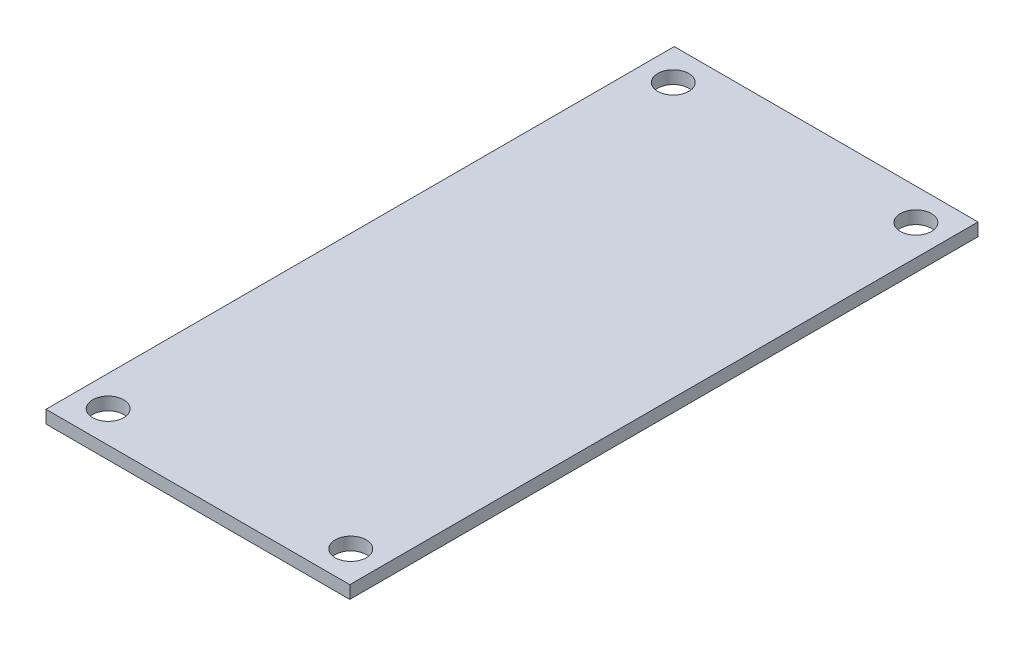
ISO-10303-21;
HEADER;
FILE_DESCRIPTION(('STEP AP214'),'2;1');
FILE_NAME('part.step','',(''),(''),'','','');
FILE_SCHEMA(('AUTOMOTIVE_DESIGN { 1 0 10303 214 1 1 1 1 }'));
ENDSEC;
DATA;
#1=APPLICATION_CONTEXT('core data for automotive mechanical design processes');
#2=APPLICATION_PROTOCOL_DEFINITION('international standard','automotive_design',2000,#1);
#3=PRODUCT_CONTEXT('',#1,'mechanical');
#4=PRODUCT('Part','Part','',(#3));
#5=PRODUCT_RELATED_PRODUCT_CATEGORY('part','',(#4));
#6=PRODUCT_DEFINITION_FORMATION('','',#4);
#7=PRODUCT_DEFINITION_CONTEXT('part definition',#1,'design');
#8=PRODUCT_DEFINITION('design','',#6,#7);
#9=PRODUCT_DEFINITION_SHAPE('','',#8);
#10=(LENGTH_UNIT() NAMED_UNIT(*) SI_UNIT(.MILLI.,.METRE.));
#11=(NAMED_UNIT(*) PLANE_ANGLE_UNIT() SI_UNIT($,.RADIAN.));
#12=(NAMED_UNIT(*) SI_UNIT($,.STERADIAN.) SOLID_ANGLE_UNIT());
#13=UNCERTAINTY_MEASURE_WITH_UNIT(LENGTH_MEASURE(1.E-05),#10,'distance_accuracy_value','');
#14=(GEOMETRIC_REPRESENTATION_CONTEXT(3) GLOBAL_UNCERTAINTY_ASSIGNED_CONTEXT((#13)) GLOBAL_UNIT_ASSIGNED_CONTEXT((#10,
#11,#12)) REPRESENTATION_CONTEXT('',''));
#15=CARTESIAN_POINT('',(0.,0.,0.));
#16=DIRECTION('',(0.,0.,1.));
#17=DIRECTION('',(1.,0.,0.));
#18=AXIS2_PLACEMENT_3D('',#15,#16,#17);
#19=CARTESIAN_POINT('',(0.,1.3,0.));
#20=DIRECTION('',(0.,-1.,0.));
#21=DIRECTION('',(0.,0.,-1.));
#22=AXIS2_PLACEMENT_3D('',#19,#20,#21);
#23=PLANE('',#22);
#24=DIRECTION('',(0.,0.,-1.));
#25=VECTOR('',#24,1.);
#26=CARTESIAN_POINT('',(15.4,1.3,31.85));
#27=LINE('',#26,#25);
#28=CARTESIAN_POINT('',(15.4,1.3,31.85));
#29=VERTEX_POINT('',#28);
#30=CARTESIAN_POINT('',(15.4,1.3,-31.85));
#31=VERTEX_POINT('',#30);
#32=EDGE_CURVE('E99',#29,#31,#27,.T.);
#33=ORIENTED_EDGE('',*,*,#32,.T.);
#34=DIRECTION('',(-1.,0.,0.));
#35=VECTOR('',#34,1.);
#36=CARTESIAN_POINT('',(-15.4,1.3,-31.85));
#37=LINE('',#36,#35);
#38=CARTESIAN_POINT('',(-15.4,1.3,-31.85));
#39=VERTEX_POINT('',#38);
#40=EDGE_CURVE('E94',#31,#39,#37,.T.);
#41=ORIENTED_EDGE('',*,*,#40,.T.);
#42=DIRECTION('',(0.,0.,1.));
#43=VECTOR('',#42,1.);
#44=CARTESIAN_POINT('',(-15.4,1.3,31.85));
#45=LINE('',#44,#43);
#46=CARTESIAN_POINT('',(-15.4,1.3,31.85));
#47=VERTEX_POINT('',#46);
#48=EDGE_CURVE('E97',#39,#47,#45,.T.);
#49=ORIENTED_EDGE('',*,*,#48,.T.);
#50=DIRECTION('',(1.,0.,0.));
#51=VECTOR('',#50,1.);
#52=CARTESIAN_POINT('',(-15.4,1.3,31.85));
#53=LINE('',#52,#51);
#54=EDGE_CURVE('E62',#47,#29,#53,.T.);
#55=ORIENTED_EDGE('',*,*,#54,.T.);
#56=EDGE_LOOP('',(#33,#41,#49,#55));
#57=FACE_BOUND('',#56,.T.);
#58=CARTESIAN_POINT('',(-12.3,1.3,-28.65));
#59=DIRECTION('',(0.,1.,0.));
#60=DIRECTION('',(0.,0.,1.));
#61=AXIS2_PLACEMENT_3D('',#58,#59,#60);
#62=CIRCLE('',#61,1.575);
#63=CARTESIAN_POINT('',(-12.3,1.3,-27.075));
#64=VERTEX_POINT('',#63);
#65=EDGE_CURVE('E120',#64,#64,#62,.T.);
#66=ORIENTED_EDGE('',*,*,#65,.F.);
#67=EDGE_LOOP('',(#66));
#68=FACE_BOUND('',#67,.T.);
#69=CARTESIAN_POINT('',(12.3,1.3,-28.65));
#70=DIRECTION('',(0.,1.,0.));
#71=DIRECTION('',(0.,0.,1.));
#72=AXIS2_PLACEMENT_3D('',#69,#70,#71);
#73=CIRCLE('',#72,1.575);
#74=CARTESIAN_POINT('',(12.3,1.3,-27.075));
#75=VERTEX_POINT('',#74);
#76=EDGE_CURVE('E143',#75,#75,#73,.T.);
#77=ORIENTED_EDGE('',*,*,#76,.F.);
#78=EDGE_LOOP('',(#77));
#79=FACE_BOUND('',#78,.T.);
#80=CARTESIAN_POINT('',(-12.3,1.3,28.65));
#81=DIRECTION('',(0.,1.,0.));
#82=DIRECTION('',(0.,0.,1.));
#83=AXIS2_PLACEMENT_3D('',#80,#81,#82);
#84=CIRCLE('',#83,1.575);
#85=CARTESIAN_POINT('',(-12.3,1.3,30.225));
#86=VERTEX_POINT('',#85);
#87=EDGE_CURVE('E151',#86,#86,#84,.T.);
#88=ORIENTED_EDGE('',*,*,#87,.F.);
#89=EDGE_LOOP('',(#88));
#90=FACE_BOUND('',#89,.T.);
#91=CARTESIAN_POINT('',(12.3,1.3,28.65));
#92=DIRECTION('',(0.,1.,0.));
#93=DIRECTION('',(0.,0.,1.));
#94=AXIS2_PLACEMENT_3D('',#91,#92,#93);
#95=CIRCLE('',#94,1.575);
#96=CARTESIAN_POINT('',(12.3,1.3,30.225));
#97=VERTEX_POINT('',#96);
#98=EDGE_CURVE('E158',#97,#97,#95,.T.);
#99=ORIENTED_EDGE('',*,*,#98,.F.);
#100=EDGE_LOOP('',(#99));
#101=FACE_BOUND('',#100,.T.);
#102=ADVANCED_FACE('F42',(#57,#68,#79,#90,#101),#23,.F.);
#103=CARTESIAN_POINT('',(0.,0.,0.));
#104=DIRECTION('',(0.,-1.,0.));
#105=DIRECTION('',(0.,0.,-1.));
#106=AXIS2_PLACEMENT_3D('',#103,#104,#105);
#107=PLANE('',#106);
#108=CARTESIAN_POINT('',(-12.3,0.,28.65));
#109=DIRECTION('',(0.,1.,0.));
#110=DIRECTION('',(0.,0.,1.));
#111=AXIS2_PLACEMENT_3D('',#108,#109,#110);
#112=CIRCLE('',#111,1.575);
#113=CARTESIAN_POINT('',(-12.3,0.,30.225));
#114=VERTEX_POINT('',#113);
#115=EDGE_CURVE('E155',#114,#114,#112,.T.);
#116=ORIENTED_EDGE('',*,*,#115,.T.);
#117=EDGE_LOOP('',(#116));
#118=FACE_BOUND('',#117,.T.);
#119=CARTESIAN_POINT('',(-12.3,0.,-28.65));
#120=DIRECTION('',(0.,1.,0.));
#121=DIRECTION('',(0.,0.,1.));
#122=AXIS2_PLACEMENT_3D('',#119,#120,#121);
#123=CIRCLE('',#122,1.575);
#124=CARTESIAN_POINT('',(-12.3,0.,-27.075));
#125=VERTEX_POINT('',#124);
#126=EDGE_CURVE('E140',#125,#125,#123,.T.);
#127=ORIENTED_EDGE('',*,*,#126,.T.);
#128=EDGE_LOOP('',(#127));
#129=FACE_BOUND('',#128,.T.);
#130=DIRECTION('',(0.,0.,-1.));
#131=VECTOR('',#130,1.);
#132=CARTESIAN_POINT('',(15.4,0.,31.85));
#133=LINE('',#132,#131);
#134=CARTESIAN_POINT('',(15.4,0.,31.85));
#135=VERTEX_POINT('',#134);
#136=CARTESIAN_POINT('',(15.4,0.,-31.85));
#137=VERTEX_POINT('',#136);
#138=EDGE_CURVE('E116',#135,#137,#133,.T.);
#139=ORIENTED_EDGE('',*,*,#138,.F.);
#140=DIRECTION('',(1.,0.,0.));
#141=VECTOR('',#140,1.);
#142=CARTESIAN_POINT('',(-15.4,0.,31.85));
#143=LINE('',#142,#141);
#144=CARTESIAN_POINT('',(-15.4,0.,31.85));
#145=VERTEX_POINT('',#144);
#146=EDGE_CURVE('E87',#145,#135,#143,.T.);
#147=ORIENTED_EDGE('',*,*,#146,.F.);
#148=DIRECTION('',(0.,0.,1.));
#149=VECTOR('',#148,1.);
#150=CARTESIAN_POINT('',(-15.4,0.,31.85));
#151=LINE('',#150,#149);
#152=CARTESIAN_POINT('',(-15.4,0.,-31.85));
#153=VERTEX_POINT('',#152);
#154=EDGE_CURVE('E81',#153,#145,#151,.T.);
#155=ORIENTED_EDGE('',*,*,#154,.F.);
#156=DIRECTION('',(-1.,0.,0.));
#157=VECTOR('',#156,1.);
#158=CARTESIAN_POINT('',(-15.4,0.,-31.85));
#159=LINE('',#158,#157);
#160=EDGE_CURVE('E104',#137,#153,#159,.T.);
#161=ORIENTED_EDGE('',*,*,#160,.F.);
#162=EDGE_LOOP('',(#139,#147,#155,#161));
#163=FACE_BOUND('',#162,.T.);
#164=CARTESIAN_POINT('',(12.3,0.,-28.65));
#165=DIRECTION('',(0.,1.,0.));
#166=DIRECTION('',(0.,0.,1.));
#167=AXIS2_PLACEMENT_3D('',#164,#165,#166);
#168=CIRCLE('',#167,1.575);
#169=CARTESIAN_POINT('',(12.3,0.,-27.075));
#170=VERTEX_POINT('',#169);
#171=EDGE_CURVE('E147',#170,#170,#168,.T.);
#172=ORIENTED_EDGE('',*,*,#171,.T.);
#173=EDGE_LOOP('',(#172));
#174=FACE_BOUND('',#173,.T.);
#175=CARTESIAN_POINT('',(12.3,0.,28.65));
#176=DIRECTION('',(0.,1.,0.));
#177=DIRECTION('',(0.,0.,1.));
#178=AXIS2_PLACEMENT_3D('',#175,#176,#177);
#179=CIRCLE('',#178,1.575);
#180=CARTESIAN_POINT('',(12.3,0.,30.225));
#181=VERTEX_POINT('',#180);
#182=EDGE_CURVE('E161',#181,#181,#179,.T.);
#183=ORIENTED_EDGE('',*,*,#182,.T.);
#184=EDGE_LOOP('',(#183));
#185=FACE_BOUND('',#184,.T.);
#186=ADVANCED_FACE('F134',(#118,#129,#163,#174,#185),#107,.T.);
#187=CARTESIAN_POINT('',(15.4,1.3,31.85));
#188=DIRECTION('',(-1.,0.,0.));
#189=DIRECTION('',(0.,0.,1.));
#190=AXIS2_PLACEMENT_3D('',#187,#188,#189);
#191=PLANE('',#190);
#192=ORIENTED_EDGE('',*,*,#138,.T.);
#193=DIRECTION('',(0.,-1.,0.));
#194=VECTOR('',#193,1.);
#195=CARTESIAN_POINT('',(15.4,1.3,-31.85));
#196=LINE('',#195,#194);
#197=EDGE_CURVE('E11',#31,#137,#196,.T.);
#198=ORIENTED_EDGE('',*,*,#197,.F.);
#199=ORIENTED_EDGE('',*,*,#32,.F.);
#200=DIRECTION('',(0.,-1.,0.));
#201=VECTOR('',#200,1.);
#202=CARTESIAN_POINT('',(15.4,1.3,31.85));
#203=LINE('',#202,#201);
#204=EDGE_CURVE('E112',#29,#135,#203,.T.);
#205=ORIENTED_EDGE('',*,*,#204,.T.);
#206=EDGE_LOOP('',(#192,#198,#199,#205));
#207=FACE_BOUND('',#206,.T.);
#208=ADVANCED_FACE('F44',(#207),#191,.F.);
#209=CARTESIAN_POINT('',(-15.4,1.3,-31.85));
#210=DIRECTION('',(0.,0.,1.));
#211=DIRECTION('',(1.,0.,0.));
#212=AXIS2_PLACEMENT_3D('',#209,#210,#211);
#213=PLANE('',#212);
#214=ORIENTED_EDGE('',*,*,#160,.T.);
#215=DIRECTION('',(0.,-1.,0.));
#216=VECTOR('',#215,1.);
#217=CARTESIAN_POINT('',(-15.4,1.3,-31.85));
#218=LINE('',#217,#216);
#219=EDGE_CURVE('E51',#39,#153,#218,.T.);
#220=ORIENTED_EDGE('',*,*,#219,.F.);
#221=ORIENTED_EDGE('',*,*,#40,.F.);
#222=ORIENTED_EDGE('',*,*,#197,.T.);
#223=EDGE_LOOP('',(#214,#220,#221,#222));
#224=FACE_BOUND('',#223,.T.);
#225=ADVANCED_FACE('F103',(#224),#213,.F.);
#226=CARTESIAN_POINT('',(-15.4,1.3,31.85));
#227=DIRECTION('',(1.,0.,0.));
#228=DIRECTION('',(0.,0.,-1.));
#229=AXIS2_PLACEMENT_3D('',#226,#227,#228);
#230=PLANE('',#229);
#231=ORIENTED_EDGE('',*,*,#154,.T.);
#232=DIRECTION('',(0.,-1.,0.));
#233=VECTOR('',#232,1.);
#234=CARTESIAN_POINT('',(-15.4,1.3,31.85));
#235=LINE('',#234,#233);
#236=EDGE_CURVE('E106',#47,#145,#235,.T.);
#237=ORIENTED_EDGE('',*,*,#236,.F.);
#238=ORIENTED_EDGE('',*,*,#48,.F.);
#239=ORIENTED_EDGE('',*,*,#219,.T.);
#240=EDGE_LOOP('',(#231,#237,#238,#239));
#241=FACE_BOUND('',#240,.T.);
#242=ADVANCED_FACE('F107',(#241),#230,.F.);
#243=CARTESIAN_POINT('',(-15.4,1.3,31.85));
#244=DIRECTION('',(0.,0.,-1.));
#245=DIRECTION('',(-1.,0.,0.));
#246=AXIS2_PLACEMENT_3D('',#243,#244,#245);
#247=PLANE('',#246);
#248=ORIENTED_EDGE('',*,*,#146,.T.);
#249=ORIENTED_EDGE('',*,*,#204,.F.);
#250=ORIENTED_EDGE('',*,*,#54,.F.);
#251=ORIENTED_EDGE('',*,*,#236,.T.);
#252=EDGE_LOOP('',(#248,#249,#250,#251));
#253=FACE_BOUND('',#252,.T.);
#254=ADVANCED_FACE('F131',(#253),#247,.F.);
#255=CARTESIAN_POINT('',(-12.3,1.3,-28.65));
#256=DIRECTION('',(0.,-1.,0.));
#257=DIRECTION('',(0.,0.,-1.));
#258=AXIS2_PLACEMENT_3D('',#255,#256,#257);
#259=CYLINDRICAL_SURFACE('',#258,1.575);
#260=ORIENTED_EDGE('',*,*,#65,.T.);
#261=EDGE_LOOP('',(#260));
#262=FACE_BOUND('',#261,.T.);
#263=ORIENTED_EDGE('',*,*,#126,.F.);
#264=EDGE_LOOP('',(#263));
#265=FACE_BOUND('',#264,.T.);
#266=ADVANCED_FACE('F180',(#262,#265),#259,.F.);
#267=CARTESIAN_POINT('',(12.3,1.3,-28.65));
#268=DIRECTION('',(0.,-1.,0.));
#269=DIRECTION('',(0.,0.,-1.));
#270=AXIS2_PLACEMENT_3D('',#267,#268,#269);
#271=CYLINDRICAL_SURFACE('',#270,1.575);
#272=ORIENTED_EDGE('',*,*,#76,.T.);
#273=EDGE_LOOP('',(#272));
#274=FACE_BOUND('',#273,.T.);
#275=ORIENTED_EDGE('',*,*,#171,.F.);
#276=EDGE_LOOP('',(#275));
#277=FACE_BOUND('',#276,.T.);
#278=ADVANCED_FACE('F218',(#274,#277),#271,.F.);
#279=CARTESIAN_POINT('',(-12.3,1.3,28.65));
#280=DIRECTION('',(0.,-1.,0.));
#281=DIRECTION('',(0.,0.,-1.));
#282=AXIS2_PLACEMENT_3D('',#279,#280,#281);
#283=CYLINDRICAL_SURFACE('',#282,1.575);
#284=ORIENTED_EDGE('',*,*,#87,.T.);
#285=EDGE_LOOP('',(#284));
#286=FACE_BOUND('',#285,.T.);
#287=ORIENTED_EDGE('',*,*,#115,.F.);
#288=EDGE_LOOP('',(#287));
#289=FACE_BOUND('',#288,.T.);
#290=ADVANCED_FACE('F222',(#286,#289),#283,.F.);
#291=CARTESIAN_POINT('',(12.3,1.3,28.65));
#292=DIRECTION('',(0.,-1.,0.));
#293=DIRECTION('',(0.,0.,-1.));
#294=AXIS2_PLACEMENT_3D('',#291,#292,#293);
#295=CYLINDRICAL_SURFACE('',#294,1.575);
#296=ORIENTED_EDGE('',*,*,#98,.T.);
#297=EDGE_LOOP('',(#296));
#298=FACE_BOUND('',#297,.T.);
#299=ORIENTED_EDGE('',*,*,#182,.F.);
#300=EDGE_LOOP('',(#299));
#301=FACE_BOUND('',#300,.T.);
#302=ADVANCED_FACE('F169',(#298,#301),#295,.F.);
#303=CLOSED_SHELL('',(#102,#186,#208,#225,#242,#254,#266,#278,#290,#302));
#304=MANIFOLD_SOLID_BREP('B2',#303);
#305=ADVANCED_BREP_SHAPE_REPRESENTATION('',(#18,#304),#14);
#306=SHAPE_DEFINITION_REPRESENTATION(#9,#305);
ENDSEC;
END-ISO-10303-21;
